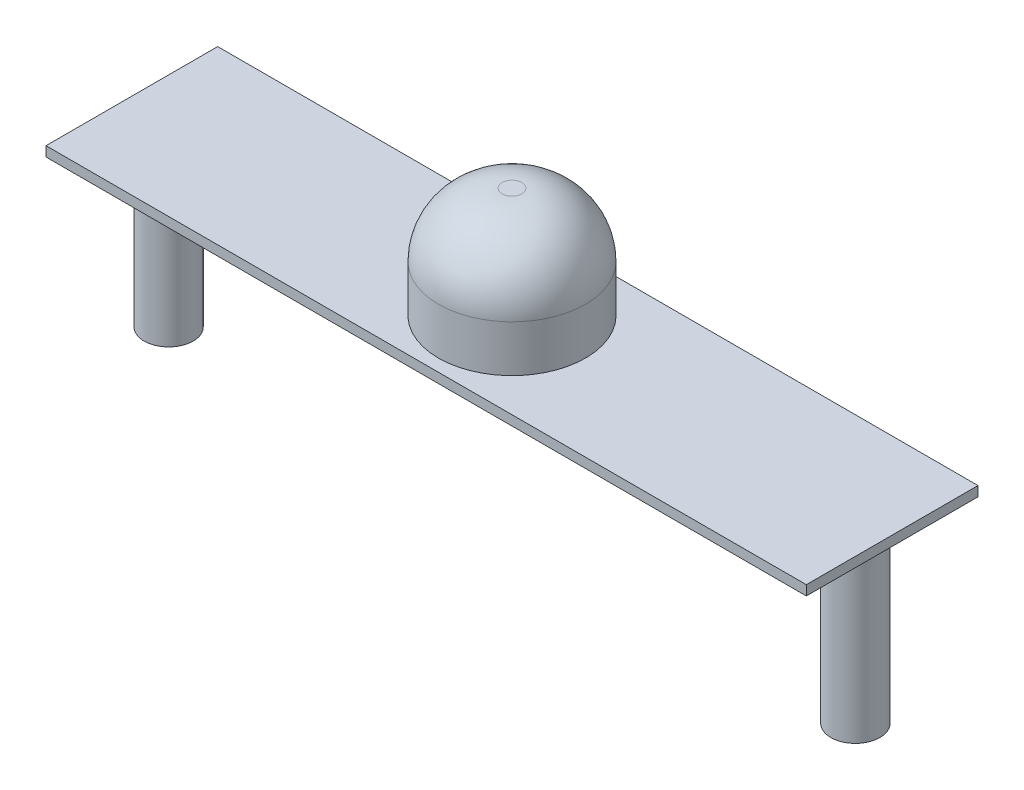
ISO-10303-21;
HEADER;
FILE_DESCRIPTION(('STEP AP214'),'2;1');
FILE_NAME('part.step','',(''),(''),'','','');
FILE_SCHEMA(('AUTOMOTIVE_DESIGN { 1 0 10303 214 1 1 1 1 }'));
ENDSEC;
DATA;
#1=APPLICATION_CONTEXT('core data for automotive mechanical design processes');
#2=APPLICATION_PROTOCOL_DEFINITION('international standard','automotive_design',2000,#1);
#3=PRODUCT_CONTEXT('',#1,'mechanical');
#4=PRODUCT('Part','Part','',(#3));
#5=PRODUCT_RELATED_PRODUCT_CATEGORY('part','',(#4));
#6=PRODUCT_DEFINITION_FORMATION('','',#4);
#7=PRODUCT_DEFINITION_CONTEXT('part definition',#1,'design');
#8=PRODUCT_DEFINITION('design','',#6,#7);
#9=PRODUCT_DEFINITION_SHAPE('','',#8);
#10=(LENGTH_UNIT() NAMED_UNIT(*) SI_UNIT(.MILLI.,.METRE.));
#11=(NAMED_UNIT(*) PLANE_ANGLE_UNIT() SI_UNIT($,.RADIAN.));
#12=(NAMED_UNIT(*) SI_UNIT($,.STERADIAN.) SOLID_ANGLE_UNIT());
#13=UNCERTAINTY_MEASURE_WITH_UNIT(LENGTH_MEASURE(1.E-05),#10,'distance_accuracy_value','');
#14=(GEOMETRIC_REPRESENTATION_CONTEXT(3) GLOBAL_UNCERTAINTY_ASSIGNED_CONTEXT((#13)) GLOBAL_UNIT_ASSIGNED_CONTEXT((#10,
#11,#12)) REPRESENTATION_CONTEXT('',''));
#15=CARTESIAN_POINT('',(0.,0.,0.));
#16=DIRECTION('',(0.,0.,1.));
#17=DIRECTION('',(1.,0.,0.));
#18=AXIS2_PLACEMENT_3D('',#15,#16,#17);
#19=CARTESIAN_POINT('',(49.2125,1.27,11.1125));
#20=DIRECTION('',(-1.,0.,0.));
#21=DIRECTION('',(0.,0.,1.));
#22=AXIS2_PLACEMENT_3D('',#19,#20,#21);
#23=PLANE('',#22);
#24=DIRECTION('',(0.,0.,-1.));
#25=VECTOR('',#24,1.);
#26=CARTESIAN_POINT('',(49.2125,0.,11.1125));
#27=LINE('',#26,#25);
#28=CARTESIAN_POINT('',(49.2125,0.,11.1125));
#29=VERTEX_POINT('',#28);
#30=CARTESIAN_POINT('',(49.2125,0.,-11.1125));
#31=VERTEX_POINT('',#30);
#32=EDGE_CURVE('E119',#29,#31,#27,.T.);
#33=ORIENTED_EDGE('',*,*,#32,.T.);
#34=DIRECTION('',(0.,-1.,0.));
#35=VECTOR('',#34,1.);
#36=CARTESIAN_POINT('',(49.2125,1.27,-11.1125));
#37=LINE('',#36,#35);
#38=CARTESIAN_POINT('',(49.2125,1.27,-11.1125));
#39=VERTEX_POINT('',#38);
#40=EDGE_CURVE('E107',#39,#31,#37,.T.);
#41=ORIENTED_EDGE('',*,*,#40,.F.);
#42=DIRECTION('',(0.,0.,-1.));
#43=VECTOR('',#42,1.);
#44=CARTESIAN_POINT('',(49.2125,1.27,11.1125));
#45=LINE('',#44,#43);
#46=CARTESIAN_POINT('',(49.2125,1.27,11.1125));
#47=VERTEX_POINT('',#46);
#48=EDGE_CURVE('E100',#47,#39,#45,.T.);
#49=ORIENTED_EDGE('',*,*,#48,.F.);
#50=DIRECTION('',(0.,-1.,0.));
#51=VECTOR('',#50,1.);
#52=CARTESIAN_POINT('',(49.2125,1.27,11.1125));
#53=LINE('',#52,#51);
#54=EDGE_CURVE('E115',#47,#29,#53,.T.);
#55=ORIENTED_EDGE('',*,*,#54,.T.);
#56=EDGE_LOOP('',(#33,#41,#49,#55));
#57=FACE_BOUND('',#56,.T.);
#58=ADVANCED_FACE('F40',(#57),#23,.F.);
#59=CARTESIAN_POINT('',(-49.2125,1.27,-11.1125));
#60=DIRECTION('',(0.,0.,1.));
#61=DIRECTION('',(1.,0.,0.));
#62=AXIS2_PLACEMENT_3D('',#59,#60,#61);
#63=PLANE('',#62);
#64=DIRECTION('',(-1.,0.,0.));
#65=VECTOR('',#64,1.);
#66=CARTESIAN_POINT('',(-49.2125,0.,-11.1125));
#67=LINE('',#66,#65);
#68=CARTESIAN_POINT('',(-49.2125,0.,-11.1125));
#69=VERTEX_POINT('',#68);
#70=EDGE_CURVE('E106',#31,#69,#67,.T.);
#71=ORIENTED_EDGE('',*,*,#70,.T.);
#72=DIRECTION('',(0.,-1.,0.));
#73=VECTOR('',#72,1.);
#74=CARTESIAN_POINT('',(-49.2125,1.27,-11.1125));
#75=LINE('',#74,#73);
#76=CARTESIAN_POINT('',(-49.2125,1.27,-11.1125));
#77=VERTEX_POINT('',#76);
#78=EDGE_CURVE('E104',#77,#69,#75,.T.);
#79=ORIENTED_EDGE('',*,*,#78,.F.);
#80=DIRECTION('',(-1.,0.,0.));
#81=VECTOR('',#80,1.);
#82=CARTESIAN_POINT('',(-49.2125,1.27,-11.1125));
#83=LINE('',#82,#81);
#84=EDGE_CURVE('E95',#39,#77,#83,.T.);
#85=ORIENTED_EDGE('',*,*,#84,.F.);
#86=ORIENTED_EDGE('',*,*,#40,.T.);
#87=EDGE_LOOP('',(#71,#79,#85,#86));
#88=FACE_BOUND('',#87,.T.);
#89=ADVANCED_FACE('F105',(#88),#63,.F.);
#90=CARTESIAN_POINT('',(-49.2125,1.27,11.1125));
#91=DIRECTION('',(1.,0.,0.));
#92=DIRECTION('',(0.,0.,-1.));
#93=AXIS2_PLACEMENT_3D('',#90,#91,#92);
#94=PLANE('',#93);
#95=DIRECTION('',(0.,0.,1.));
#96=VECTOR('',#95,1.);
#97=CARTESIAN_POINT('',(-49.2125,0.,11.1125));
#98=LINE('',#97,#96);
#99=CARTESIAN_POINT('',(-49.2125,0.,11.1125));
#100=VERTEX_POINT('',#99);
#101=EDGE_CURVE('E81',#69,#100,#98,.T.);
#102=ORIENTED_EDGE('',*,*,#101,.T.);
#103=DIRECTION('',(0.,-1.,0.));
#104=VECTOR('',#103,1.);
#105=CARTESIAN_POINT('',(-49.2125,1.27,11.1125));
#106=LINE('',#105,#104);
#107=CARTESIAN_POINT('',(-49.2125,1.27,11.1125));
#108=VERTEX_POINT('',#107);
#109=EDGE_CURVE('E108',#108,#100,#106,.T.);
#110=ORIENTED_EDGE('',*,*,#109,.F.);
#111=DIRECTION('',(0.,0.,1.));
#112=VECTOR('',#111,1.);
#113=CARTESIAN_POINT('',(-49.2125,1.27,11.1125));
#114=LINE('',#113,#112);
#115=EDGE_CURVE('E98',#77,#108,#114,.T.);
#116=ORIENTED_EDGE('',*,*,#115,.F.);
#117=ORIENTED_EDGE('',*,*,#78,.T.);
#118=EDGE_LOOP('',(#102,#110,#116,#117));
#119=FACE_BOUND('',#118,.T.);
#120=ADVANCED_FACE('F110',(#119),#94,.F.);
#121=CARTESIAN_POINT('',(-49.2125,1.27,11.1125));
#122=DIRECTION('',(0.,0.,-1.));
#123=DIRECTION('',(-1.,0.,0.));
#124=AXIS2_PLACEMENT_3D('',#121,#122,#123);
#125=PLANE('',#124);
#126=DIRECTION('',(1.,0.,0.));
#127=VECTOR('',#126,1.);
#128=CARTESIAN_POINT('',(-49.2125,0.,11.1125));
#129=LINE('',#128,#127);
#130=EDGE_CURVE('E87',#100,#29,#129,.T.);
#131=ORIENTED_EDGE('',*,*,#130,.T.);
#132=ORIENTED_EDGE('',*,*,#54,.F.);
#133=DIRECTION('',(1.,0.,0.));
#134=VECTOR('',#133,1.);
#135=CARTESIAN_POINT('',(-49.2125,1.27,11.1125));
#136=LINE('',#135,#134);
#137=EDGE_CURVE('E61',#108,#47,#136,.T.);
#138=ORIENTED_EDGE('',*,*,#137,.F.);
#139=ORIENTED_EDGE('',*,*,#109,.T.);
#140=EDGE_LOOP('',(#131,#132,#138,#139));
#141=FACE_BOUND('',#140,.T.);
#142=ADVANCED_FACE('F179',(#141),#125,.F.);
#143=CARTESIAN_POINT('',(0.,1.27,0.));
#144=DIRECTION('',(0.,-1.,0.));
#145=DIRECTION('',(0.,0.,-1.));
#146=AXIS2_PLACEMENT_3D('',#143,#144,#145);
#147=PLANE('',#146);
#148=CARTESIAN_POINT('',(0.,1.27,0.));
#149=DIRECTION('',(0.,1.,0.));
#150=DIRECTION('',(0.,0.,1.));
#151=AXIS2_PLACEMENT_3D('',#148,#149,#150);
#152=CIRCLE('',#151,9.525);
#153=CARTESIAN_POINT('',(0.,1.27,9.525));
#154=VERTEX_POINT('',#153);
#155=EDGE_CURVE('E134',#154,#154,#152,.T.);
#156=ORIENTED_EDGE('',*,*,#155,.F.);
#157=EDGE_LOOP('',(#156));
#158=FACE_BOUND('',#157,.T.);
#159=ORIENTED_EDGE('',*,*,#48,.T.);
#160=ORIENTED_EDGE('',*,*,#84,.T.);
#161=ORIENTED_EDGE('',*,*,#115,.T.);
#162=ORIENTED_EDGE('',*,*,#137,.T.);
#163=EDGE_LOOP('',(#159,#160,#161,#162));
#164=FACE_BOUND('',#163,.T.);
#165=ADVANCED_FACE('F96',(#158,#164),#147,.F.);
#166=CARTESIAN_POINT('',(0.,0.,0.));
#167=DIRECTION('',(0.,-1.,0.));
#168=DIRECTION('',(0.,0.,-1.));
#169=AXIS2_PLACEMENT_3D('',#166,#167,#168);
#170=PLANE('',#169);
#171=CARTESIAN_POINT('',(44.45,0.,0.));
#172=DIRECTION('',(0.,-1.,0.));
#173=DIRECTION('',(0.,0.,1.));
#174=AXIS2_PLACEMENT_3D('',#171,#172,#173);
#175=CIRCLE('',#174,3.175);
#176=CARTESIAN_POINT('',(44.45,0.,3.17499999999999));
#177=VERTEX_POINT('',#176);
#178=EDGE_CURVE('E148',#177,#177,#175,.T.);
#179=ORIENTED_EDGE('',*,*,#178,.F.);
#180=EDGE_LOOP('',(#179));
#181=FACE_BOUND('',#180,.T.);
#182=CARTESIAN_POINT('',(-44.45,0.,0.));
#183=DIRECTION('',(0.,-1.,0.));
#184=DIRECTION('',(0.,0.,-1.));
#185=AXIS2_PLACEMENT_3D('',#182,#183,#184);
#186=CIRCLE('',#185,3.175);
#187=CARTESIAN_POINT('',(-44.45,0.,-3.175));
#188=VERTEX_POINT('',#187);
#189=EDGE_CURVE('E145',#188,#188,#186,.T.);
#190=ORIENTED_EDGE('',*,*,#189,.F.);
#191=EDGE_LOOP('',(#190));
#192=FACE_BOUND('',#191,.T.);
#193=ORIENTED_EDGE('',*,*,#32,.F.);
#194=ORIENTED_EDGE('',*,*,#130,.F.);
#195=ORIENTED_EDGE('',*,*,#101,.F.);
#196=ORIENTED_EDGE('',*,*,#70,.F.);
#197=EDGE_LOOP('',(#193,#194,#195,#196));
#198=FACE_BOUND('',#197,.T.);
#199=ADVANCED_FACE('F171',(#181,#192,#198),#170,.T.);
#200=CARTESIAN_POINT('',(0.,15.5575,0.));
#201=DIRECTION('',(0.,-1.,0.));
#202=DIRECTION('',(0.,0.,-1.));
#203=AXIS2_PLACEMENT_3D('',#200,#201,#202);
#204=CYLINDRICAL_SURFACE('',#203,9.525);
#205=CARTESIAN_POINT('',(0.,7.3025,0.));
#206=DIRECTION('',(0.,1.,0.));
#207=DIRECTION('',(0.,0.,1.));
#208=AXIS2_PLACEMENT_3D('',#205,#206,#207);
#209=CIRCLE('',#208,9.525);
#210=CARTESIAN_POINT('',(0.,7.3025,9.525));
#211=VERTEX_POINT('',#210);
#212=EDGE_CURVE('E11',#211,#211,#209,.F.);
#213=ORIENTED_EDGE('',*,*,#212,.T.);
#214=EDGE_LOOP('',(#213));
#215=FACE_BOUND('',#214,.T.);
#216=ORIENTED_EDGE('',*,*,#155,.T.);
#217=EDGE_LOOP('',(#216));
#218=FACE_BOUND('',#217,.T.);
#219=ADVANCED_FACE('F174',(#215,#218),#204,.T.);
#220=CARTESIAN_POINT('',(0.,15.5575,0.));
#221=DIRECTION('',(0.,1.,0.));
#222=DIRECTION('',(0.,0.,1.));
#223=AXIS2_PLACEMENT_3D('',#220,#221,#222);
#224=PLANE('',#223);
#225=CARTESIAN_POINT('',(0.,15.5575,0.));
#226=DIRECTION('',(0.,1.,0.));
#227=DIRECTION('',(0.,0.,1.));
#228=AXIS2_PLACEMENT_3D('',#225,#226,#227);
#229=CIRCLE('',#228,1.27);
#230=CARTESIAN_POINT('',(0.,15.5575,1.27));
#231=VERTEX_POINT('',#230);
#232=EDGE_CURVE('E50',#231,#231,#229,.T.);
#233=ORIENTED_EDGE('',*,*,#232,.T.);
#234=EDGE_LOOP('',(#233));
#235=FACE_BOUND('',#234,.T.);
#236=ADVANCED_FACE('F223',(#235),#224,.T.);
#237=CARTESIAN_POINT('',(0.,7.3025,0.));
#238=DIRECTION('',(0.,1.,0.));
#239=DIRECTION('',(0.,0.,1.));
#240=AXIS2_PLACEMENT_3D('',#237,#238,#239);
#241=DEGENERATE_TOROIDAL_SURFACE('',#240,1.27,8.255,.T.);
#242=ORIENTED_EDGE('',*,*,#212,.F.);
#243=EDGE_LOOP('',(#242));
#244=FACE_BOUND('',#243,.T.);
#245=ORIENTED_EDGE('',*,*,#232,.F.);
#246=EDGE_LOOP('',(#245));
#247=FACE_BOUND('',#246,.T.);
#248=ADVANCED_FACE('F42',(#244,#247),#241,.T.);
#249=CARTESIAN_POINT('',(-44.45,-22.225,0.));
#250=DIRECTION('',(0.,1.,0.));
#251=DIRECTION('',(0.,0.,1.));
#252=AXIS2_PLACEMENT_3D('',#249,#250,#251);
#253=CYLINDRICAL_SURFACE('',#252,3.175);
#254=CARTESIAN_POINT('',(-44.45,-22.225,0.));
#255=DIRECTION('',(0.,-1.,0.));
#256=DIRECTION('',(0.,0.,-1.));
#257=AXIS2_PLACEMENT_3D('',#254,#255,#256);
#258=CIRCLE('',#257,3.175);
#259=CARTESIAN_POINT('',(-44.45,-22.225,-3.175));
#260=VERTEX_POINT('',#259);
#261=EDGE_CURVE('E123',#260,#260,#258,.T.);
#262=ORIENTED_EDGE('',*,*,#261,.F.);
#263=EDGE_LOOP('',(#262));
#264=FACE_BOUND('',#263,.T.);
#265=ORIENTED_EDGE('',*,*,#189,.T.);
#266=EDGE_LOOP('',(#265));
#267=FACE_BOUND('',#266,.T.);
#268=ADVANCED_FACE('F165',(#264,#267),#253,.T.);
#269=CARTESIAN_POINT('',(-44.45,-22.225,0.));
#270=DIRECTION('',(0.,-1.,0.));
#271=DIRECTION('',(0.,0.,-1.));
#272=AXIS2_PLACEMENT_3D('',#269,#270,#271);
#273=PLANE('',#272);
#274=ORIENTED_EDGE('',*,*,#261,.T.);
#275=EDGE_LOOP('',(#274));
#276=FACE_BOUND('',#275,.T.);
#277=ADVANCED_FACE('F163',(#276),#273,.T.);
#278=CARTESIAN_POINT('',(44.45,-22.225,0.));
#279=DIRECTION('',(0.,1.,0.));
#280=DIRECTION('',(0.,0.,1.));
#281=AXIS2_PLACEMENT_3D('',#278,#279,#280);
#282=CYLINDRICAL_SURFACE('',#281,3.175);
#283=CARTESIAN_POINT('',(44.45,-22.225,0.));
#284=DIRECTION('',(0.,-1.,0.));
#285=DIRECTION('',(0.,0.,1.));
#286=AXIS2_PLACEMENT_3D('',#283,#284,#285);
#287=CIRCLE('',#286,3.175);
#288=CARTESIAN_POINT('',(44.45,-22.225,3.17499999999999));
#289=VERTEX_POINT('',#288);
#290=EDGE_CURVE('E150',#289,#289,#287,.T.);
#291=ORIENTED_EDGE('',*,*,#290,.F.);
#292=EDGE_LOOP('',(#291));
#293=FACE_BOUND('',#292,.T.);
#294=ORIENTED_EDGE('',*,*,#178,.T.);
#295=EDGE_LOOP('',(#294));
#296=FACE_BOUND('',#295,.T.);
#297=ADVANCED_FACE('F262',(#293,#296),#282,.T.);
#298=CARTESIAN_POINT('',(44.45,-22.225,0.));
#299=DIRECTION('',(0.,1.,0.));
#300=DIRECTION('',(0.,0.,1.));
#301=AXIS2_PLACEMENT_3D('',#298,#299,#300);
#302=PLANE('',#301);
#303=ORIENTED_EDGE('',*,*,#290,.T.);
#304=EDGE_LOOP('',(#303));
#305=FACE_BOUND('',#304,.T.);
#306=ADVANCED_FACE('F271',(#305),#302,.F.);
#307=CLOSED_SHELL('',(#58,#89,#120,#142,#165,#199,#219,#236,#248,#268,#277,#297,#306));
#308=MANIFOLD_SOLID_BREP('B2',#307);
#309=ADVANCED_BREP_SHAPE_REPRESENTATION('',(#18,#308),#14);
#310=SHAPE_DEFINITION_REPRESENTATION(#9,#309);
ENDSEC;
END-ISO-10303-21;
